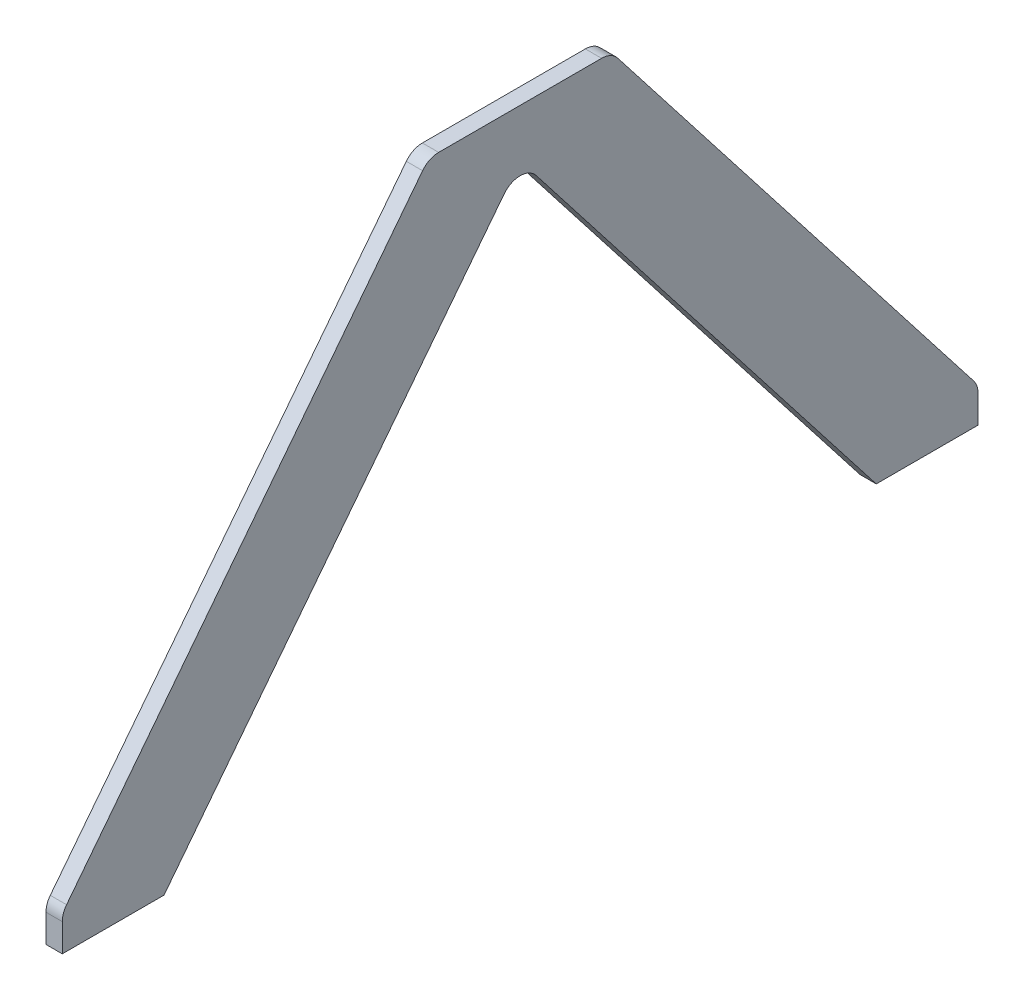
ISO-10303-21;
HEADER;
FILE_DESCRIPTION(('STEP AP214'),'2;1');
FILE_NAME('part.step','',(''),(''),'','','');
FILE_SCHEMA(('AUTOMOTIVE_DESIGN { 1 0 10303 214 1 1 1 1 }'));
ENDSEC;
DATA;
#1=APPLICATION_CONTEXT('core data for automotive mechanical design processes');
#2=APPLICATION_PROTOCOL_DEFINITION('international standard','automotive_design',2000,#1);
#3=PRODUCT_CONTEXT('',#1,'mechanical');
#4=PRODUCT('Part','Part','',(#3));
#5=PRODUCT_RELATED_PRODUCT_CATEGORY('part','',(#4));
#6=PRODUCT_DEFINITION_FORMATION('','',#4);
#7=PRODUCT_DEFINITION_CONTEXT('part definition',#1,'design');
#8=PRODUCT_DEFINITION('design','',#6,#7);
#9=PRODUCT_DEFINITION_SHAPE('','',#8);
#10=(LENGTH_UNIT() NAMED_UNIT(*) SI_UNIT(.MILLI.,.METRE.));
#11=(NAMED_UNIT(*) PLANE_ANGLE_UNIT() SI_UNIT($,.RADIAN.));
#12=(NAMED_UNIT(*) SI_UNIT($,.STERADIAN.) SOLID_ANGLE_UNIT());
#13=UNCERTAINTY_MEASURE_WITH_UNIT(LENGTH_MEASURE(1.E-05),#10,'distance_accuracy_value','');
#14=(GEOMETRIC_REPRESENTATION_CONTEXT(3) GLOBAL_UNCERTAINTY_ASSIGNED_CONTEXT((#13)) GLOBAL_UNIT_ASSIGNED_CONTEXT((#10,
#11,#12)) REPRESENTATION_CONTEXT('',''));
#15=CARTESIAN_POINT('',(0.,0.,0.));
#16=DIRECTION('',(0.,0.,1.));
#17=DIRECTION('',(1.,0.,0.));
#18=AXIS2_PLACEMENT_3D('',#15,#16,#17);
#19=CARTESIAN_POINT('',(1.11022302462516E-13,-25.,140.));
#20=DIRECTION('',(0.,0.,1.));
#21=DIRECTION('',(1.,0.,0.));
#22=AXIS2_PLACEMENT_3D('',#19,#20,#21);
#23=PLANE('',#22);
#24=DIRECTION('',(0.,1.,0.));
#25=VECTOR('',#24,1.);
#26=CARTESIAN_POINT('',(548.,0.,140.));
#27=LINE('',#26,#25);
#28=CARTESIAN_POINT('',(548.,0.,140.));
#29=VERTEX_POINT('',#28);
#30=CARTESIAN_POINT('',(548.,13.7269856950766,140.));
#31=VERTEX_POINT('',#30);
#32=EDGE_CURVE('E200',#29,#31,#27,.T.);
#33=ORIENTED_EDGE('',*,*,#32,.T.);
#34=DIRECTION('',(-1.,0.,0.));
#35=VECTOR('',#34,1.);
#36=CARTESIAN_POINT('',(540.,13.7269856950766,140.));
#37=LINE('',#36,#35);
#38=CARTESIAN_POINT('',(540.,13.7269856950766,140.));
#39=VERTEX_POINT('',#38);
#40=EDGE_CURVE('E204',#31,#39,#37,.T.);
#41=ORIENTED_EDGE('',*,*,#40,.T.);
#42=DIRECTION('',(0.,-1.,0.));
#43=VECTOR('',#42,1.);
#44=CARTESIAN_POINT('',(540.,0.,140.));
#45=LINE('',#44,#43);
#46=CARTESIAN_POINT('',(539.999999999998,0.,140.));
#47=VERTEX_POINT('',#46);
#48=EDGE_CURVE('E196',#39,#47,#45,.T.);
#49=ORIENTED_EDGE('',*,*,#48,.T.);
#50=DIRECTION('',(1.,0.,0.));
#51=VECTOR('',#50,1.);
#52=CARTESIAN_POINT('',(1.11022302462516E-13,0.,140.));
#53=LINE('',#52,#51);
#54=EDGE_CURVE('E197',#47,#29,#53,.T.);
#55=ORIENTED_EDGE('',*,*,#54,.T.);
#56=EDGE_LOOP('',(#33,#41,#49,#55));
#57=FACE_BOUND('',#56,.T.);
#58=ADVANCED_FACE('F34',(#57),#23,.T.);
#59=CARTESIAN_POINT('',(4.44089209850063E-13,0.,115.));
#60=DIRECTION('',(0.,1.,0.));
#61=DIRECTION('',(0.,0.,1.));
#62=AXIS2_PLACEMENT_3D('',#59,#60,#61);
#63=PLANE('',#62);
#64=ORIENTED_EDGE('',*,*,#54,.F.);
#65=DIRECTION('',(0.,0.,1.));
#66=VECTOR('',#65,1.);
#67=CARTESIAN_POINT('',(540.,0.,90.));
#68=LINE('',#67,#66);
#69=CARTESIAN_POINT('',(540.,0.,90.));
#70=VERTEX_POINT('',#69);
#71=EDGE_CURVE('E179',#70,#47,#68,.T.);
#72=ORIENTED_EDGE('',*,*,#71,.F.);
#73=DIRECTION('',(-1.,0.,0.));
#74=VECTOR('',#73,1.);
#75=CARTESIAN_POINT('',(548.,0.,89.9999999999999));
#76=LINE('',#75,#74);
#77=CARTESIAN_POINT('',(548.,0.,89.9999999999999));
#78=VERTEX_POINT('',#77);
#79=EDGE_CURVE('E176',#78,#70,#76,.T.);
#80=ORIENTED_EDGE('',*,*,#79,.F.);
#81=DIRECTION('',(0.,0.,-1.));
#82=VECTOR('',#81,1.);
#83=CARTESIAN_POINT('',(548.,0.,89.9999999999999));
#84=LINE('',#83,#82);
#85=EDGE_CURVE('E191',#29,#78,#84,.T.);
#86=ORIENTED_EDGE('',*,*,#85,.F.);
#87=EDGE_LOOP('',(#64,#72,#80,#86));
#88=FACE_BOUND('',#87,.T.);
#89=ADVANCED_FACE('F260',(#88),#63,.F.);
#90=CARTESIAN_POINT('',(548.,0.,89.9999999999999));
#91=DIRECTION('',(-1.,0.,0.));
#92=DIRECTION('',(0.,0.,1.));
#93=AXIS2_PLACEMENT_3D('',#90,#91,#92);
#94=PLANE('',#93);
#95=DIRECTION('',(0.,0.789278728365052,-0.614035087719298));
#96=VECTOR('',#95,1.);
#97=CARTESIAN_POINT('',(548.,30.701754385965,129.463936418253));
#98=LINE('',#97,#96);
#99=CARTESIAN_POINT('',(548.,19.8673365722696,137.89278728365));
#100=VERTEX_POINT('',#99);
#101=CARTESIAN_POINT('',(548.,244.763150312185,-37.0693848295465));
#102=VERTEX_POINT('',#101);
#103=EDGE_CURVE('E188',#100,#102,#98,.T.);
#104=ORIENTED_EDGE('',*,*,#103,.F.);
#105=CARTESIAN_POINT('',(548.,13.7269856950766,130.));
#106=DIRECTION('',(-1.,0.,0.));
#107=DIRECTION('',(0.,0.,1.));
#108=AXIS2_PLACEMENT_3D('',#105,#106,#107);
#109=CIRCLE('',#108,10.);
#110=EDGE_CURVE('E223',#100,#31,#109,.F.);
#111=ORIENTED_EDGE('',*,*,#110,.T.);
#112=ORIENTED_EDGE('',*,*,#32,.F.);
#113=ORIENTED_EDGE('',*,*,#85,.T.);
#114=DIRECTION('',(0.,0.789278728365052,-0.614035087719298));
#115=VECTOR('',#114,1.);
#116=CARTESIAN_POINT('',(548.,0.,89.9999999999999));
#117=LINE('',#116,#115);
#118=CARTESIAN_POINT('',(548.,214.799074175519,-77.1072127163495));
#119=VERTEX_POINT('',#118);
#120=EDGE_CURVE('E146',#78,#119,#117,.T.);
#121=ORIENTED_EDGE('',*,*,#120,.T.);
#122=CARTESIAN_POINT('',(548.,208.658723298326,-85.));
#123=DIRECTION('',(-1.,0.,0.));
#124=DIRECTION('',(0.,0.,1.));
#125=AXIS2_PLACEMENT_3D('',#122,#123,#124);
#126=CIRCLE('',#125,10.);
#127=CARTESIAN_POINT('',(548.,214.799074175519,-92.8927872836505));
#128=VERTEX_POINT('',#127);
#129=EDGE_CURVE('E42',#119,#128,#126,.T.);
#130=ORIENTED_EDGE('',*,*,#129,.T.);
#131=DIRECTION('',(0.,0.789278728365052,0.614035087719298));
#132=VECTOR('',#131,1.);
#133=CARTESIAN_POINT('',(548.,0.,-260.));
#134=LINE('',#133,#132);
#135=CARTESIAN_POINT('',(548.,0.,-260.));
#136=VERTEX_POINT('',#135);
#137=EDGE_CURVE('E154',#136,#128,#134,.T.);
#138=ORIENTED_EDGE('',*,*,#137,.F.);
#139=DIRECTION('',(0.,0.,-1.));
#140=VECTOR('',#139,1.);
#141=CARTESIAN_POINT('',(548.,0.,-299.463936418253));
#142=LINE('',#141,#140);
#143=CARTESIAN_POINT('',(548.000000000002,0.,-310.));
#144=VERTEX_POINT('',#143);
#145=EDGE_CURVE('E150',#136,#144,#142,.T.);
#146=ORIENTED_EDGE('',*,*,#145,.T.);
#147=DIRECTION('',(0.,-1.,0.));
#148=VECTOR('',#147,1.);
#149=CARTESIAN_POINT('',(548.,30.701754385965,-310.));
#150=LINE('',#149,#148);
#151=CARTESIAN_POINT('',(548.,13.7269856950767,-310.));
#152=VERTEX_POINT('',#151);
#153=EDGE_CURVE('E138',#152,#144,#150,.T.);
#154=ORIENTED_EDGE('',*,*,#153,.F.);
#155=CARTESIAN_POINT('',(548.000000000001,13.7269856950767,-300.));
#156=DIRECTION('',(-1.,0.,0.));
#157=DIRECTION('',(0.,0.,1.));
#158=AXIS2_PLACEMENT_3D('',#155,#156,#157);
#159=CIRCLE('',#158,10.);
#160=CARTESIAN_POINT('',(548.,19.8673365722697,-307.89278728365));
#161=VERTEX_POINT('',#160);
#162=EDGE_CURVE('E220',#152,#161,#159,.F.);
#163=ORIENTED_EDGE('',*,*,#162,.T.);
#164=DIRECTION('',(0.,0.789278728365052,0.614035087719298));
#165=VECTOR('',#164,1.);
#166=CARTESIAN_POINT('',(548.,30.701754385965,-299.463936418253));
#167=LINE('',#166,#165);
#168=CARTESIAN_POINT('',(548.,244.763150312184,-132.930615170453));
#169=VERTEX_POINT('',#168);
#170=EDGE_CURVE('E159',#161,#169,#167,.T.);
#171=ORIENTED_EDGE('',*,*,#170,.T.);
#172=CARTESIAN_POINT('',(548.,238.622799434992,-125.037827886803));
#173=DIRECTION('',(-1.,0.,0.));
#174=DIRECTION('',(0.,0.,1.));
#175=AXIS2_PLACEMENT_3D('',#172,#173,#174);
#176=CIRCLE('',#175,10.);
#177=CARTESIAN_POINT('',(548.,248.622799434992,-125.037827886803));
#178=VERTEX_POINT('',#177);
#179=EDGE_CURVE('E49',#169,#178,#176,.F.);
#180=ORIENTED_EDGE('',*,*,#179,.T.);
#181=DIRECTION('',(0.,0.,-1.));
#182=VECTOR('',#181,1.);
#183=CARTESIAN_POINT('',(547.999999999999,248.622799434992,89.9999999999999));
#184=LINE('',#183,#182);
#185=CARTESIAN_POINT('',(548.,248.622799434992,-44.962172113197));
#186=VERTEX_POINT('',#185);
#187=EDGE_CURVE('E177',#186,#178,#184,.T.);
#188=ORIENTED_EDGE('',*,*,#187,.F.);
#189=CARTESIAN_POINT('',(548.,238.622799434992,-44.962172113197));
#190=DIRECTION('',(-1.,0.,0.));
#191=DIRECTION('',(0.,0.,1.));
#192=AXIS2_PLACEMENT_3D('',#189,#190,#191);
#193=CIRCLE('',#192,10.);
#194=EDGE_CURVE('E57',#186,#102,#193,.F.);
#195=ORIENTED_EDGE('',*,*,#194,.T.);
#196=EDGE_LOOP('',(#104,#111,#112,#113,#121,#130,#138,#146,#154,#163,#171,#180,#188,#195));
#197=FACE_BOUND('',#196,.T.);
#198=ADVANCED_FACE('F152',(#197),#94,.F.);
#199=CARTESIAN_POINT('',(540.,30.701754385965,129.463936418253));
#200=DIRECTION('',(0.,-0.614035087719298,-0.789278728365052));
#201=DIRECTION('',(0.,0.789278728365052,-0.614035087719298));
#202=AXIS2_PLACEMENT_3D('',#199,#200,#201);
#203=PLANE('',#202);
#204=DIRECTION('',(0.,0.789278728365052,-0.614035087719298));
#205=VECTOR('',#204,1.);
#206=CARTESIAN_POINT('',(540.,30.701754385965,129.463936418253));
#207=LINE('',#206,#205);
#208=CARTESIAN_POINT('',(540.,19.8673365722696,137.892787283651));
#209=VERTEX_POINT('',#208);
#210=CARTESIAN_POINT('',(540.,244.763150312185,-37.0693848295466));
#211=VERTEX_POINT('',#210);
#212=EDGE_CURVE('E185',#209,#211,#207,.T.);
#213=ORIENTED_EDGE('',*,*,#212,.F.);
#214=DIRECTION('',(-1.,0.,0.));
#215=VECTOR('',#214,1.);
#216=CARTESIAN_POINT('',(548.,19.8673365722696,137.89278728365));
#217=LINE('',#216,#215);
#218=EDGE_CURVE('E217',#209,#100,#217,.F.);
#219=ORIENTED_EDGE('',*,*,#218,.T.);
#220=ORIENTED_EDGE('',*,*,#103,.T.);
#221=DIRECTION('',(1.,0.,0.));
#222=VECTOR('',#221,1.);
#223=CARTESIAN_POINT('',(540.,244.763150312184,-37.0693848295465));
#224=LINE('',#223,#222);
#225=EDGE_CURVE('E215',#102,#211,#224,.F.);
#226=ORIENTED_EDGE('',*,*,#225,.T.);
#227=EDGE_LOOP('',(#213,#219,#220,#226));
#228=FACE_BOUND('',#227,.T.);
#229=ADVANCED_FACE('F270',(#228),#203,.F.);
#230=CARTESIAN_POINT('',(540.,0.,90.));
#231=DIRECTION('',(1.,0.,0.));
#232=DIRECTION('',(0.,0.,-1.));
#233=AXIS2_PLACEMENT_3D('',#230,#231,#232);
#234=PLANE('',#233);
#235=ORIENTED_EDGE('',*,*,#48,.F.);
#236=CARTESIAN_POINT('',(540.,13.7269856950766,130.));
#237=DIRECTION('',(1.,0.,0.));
#238=DIRECTION('',(0.,0.,-1.));
#239=AXIS2_PLACEMENT_3D('',#236,#237,#238);
#240=CIRCLE('',#239,10.);
#241=EDGE_CURVE('E213',#39,#209,#240,.F.);
#242=ORIENTED_EDGE('',*,*,#241,.T.);
#243=ORIENTED_EDGE('',*,*,#212,.T.);
#244=CARTESIAN_POINT('',(540.,238.622799434992,-44.9621721131971));
#245=DIRECTION('',(1.,0.,0.));
#246=DIRECTION('',(0.,0.,-1.));
#247=AXIS2_PLACEMENT_3D('',#244,#245,#246);
#248=CIRCLE('',#247,10.);
#249=CARTESIAN_POINT('',(540.,248.622799434992,-44.9621721131971));
#250=VERTEX_POINT('',#249);
#251=EDGE_CURVE('E211',#211,#250,#248,.F.);
#252=ORIENTED_EDGE('',*,*,#251,.T.);
#253=DIRECTION('',(0.,0.,1.));
#254=VECTOR('',#253,1.);
#255=CARTESIAN_POINT('',(539.999999999999,248.622799434992,90.));
#256=LINE('',#255,#254);
#257=CARTESIAN_POINT('',(540.,248.622799434992,-125.037827886803));
#258=VERTEX_POINT('',#257);
#259=EDGE_CURVE('E180',#258,#250,#256,.T.);
#260=ORIENTED_EDGE('',*,*,#259,.F.);
#261=CARTESIAN_POINT('',(540.,238.622799434992,-125.037827886803));
#262=DIRECTION('',(1.,0.,0.));
#263=DIRECTION('',(0.,0.,-1.));
#264=AXIS2_PLACEMENT_3D('',#261,#262,#263);
#265=CIRCLE('',#264,10.);
#266=CARTESIAN_POINT('',(540.,244.763150312184,-132.930615170454));
#267=VERTEX_POINT('',#266);
#268=EDGE_CURVE('E207',#258,#267,#265,.F.);
#269=ORIENTED_EDGE('',*,*,#268,.T.);
#270=DIRECTION('',(0.,0.789278728365052,0.614035087719298));
#271=VECTOR('',#270,1.);
#272=CARTESIAN_POINT('',(540.,30.701754385965,-299.463936418252));
#273=LINE('',#272,#271);
#274=CARTESIAN_POINT('',(540.,19.8673365722697,-307.89278728365));
#275=VERTEX_POINT('',#274);
#276=EDGE_CURVE('E158',#275,#267,#273,.T.);
#277=ORIENTED_EDGE('',*,*,#276,.F.);
#278=CARTESIAN_POINT('',(540.000000000001,13.7269856950767,-300.));
#279=DIRECTION('',(1.,0.,0.));
#280=DIRECTION('',(0.,0.,-1.));
#281=AXIS2_PLACEMENT_3D('',#278,#279,#280);
#282=CIRCLE('',#281,10.);
#283=CARTESIAN_POINT('',(540.,13.7269856950767,-310.));
#284=VERTEX_POINT('',#283);
#285=EDGE_CURVE('E209',#275,#284,#282,.F.);
#286=ORIENTED_EDGE('',*,*,#285,.T.);
#287=DIRECTION('',(0.,1.,0.));
#288=VECTOR('',#287,1.);
#289=CARTESIAN_POINT('',(540.,30.701754385965,-310.));
#290=LINE('',#289,#288);
#291=CARTESIAN_POINT('',(540.,0.,-310.));
#292=VERTEX_POINT('',#291);
#293=EDGE_CURVE('E147',#292,#284,#290,.T.);
#294=ORIENTED_EDGE('',*,*,#293,.F.);
#295=DIRECTION('',(0.,0.,1.));
#296=VECTOR('',#295,1.);
#297=CARTESIAN_POINT('',(540.,0.,-299.463936418253));
#298=LINE('',#297,#296);
#299=CARTESIAN_POINT('',(540.,0.,-260.));
#300=VERTEX_POINT('',#299);
#301=EDGE_CURVE('E162',#292,#300,#298,.T.);
#302=ORIENTED_EDGE('',*,*,#301,.T.);
#303=DIRECTION('',(0.,0.789278728365052,0.614035087719298));
#304=VECTOR('',#303,1.);
#305=CARTESIAN_POINT('',(540.,0.,-260.));
#306=LINE('',#305,#304);
#307=CARTESIAN_POINT('',(540.,214.799074175519,-92.8927872836505));
#308=VERTEX_POINT('',#307);
#309=EDGE_CURVE('E248',#300,#308,#306,.T.);
#310=ORIENTED_EDGE('',*,*,#309,.T.);
#311=CARTESIAN_POINT('',(540.,208.658723298326,-85.));
#312=DIRECTION('',(1.,0.,0.));
#313=DIRECTION('',(0.,0.,-1.));
#314=AXIS2_PLACEMENT_3D('',#311,#312,#313);
#315=CIRCLE('',#314,10.);
#316=CARTESIAN_POINT('',(540.,214.799074175519,-77.1072127163495));
#317=VERTEX_POINT('',#316);
#318=EDGE_CURVE('E11',#308,#317,#315,.T.);
#319=ORIENTED_EDGE('',*,*,#318,.T.);
#320=DIRECTION('',(0.,0.789278728365052,-0.614035087719298));
#321=VECTOR('',#320,1.);
#322=CARTESIAN_POINT('',(540.,0.,90.));
#323=LINE('',#322,#321);
#324=EDGE_CURVE('E173',#70,#317,#323,.T.);
#325=ORIENTED_EDGE('',*,*,#324,.F.);
#326=ORIENTED_EDGE('',*,*,#71,.T.);
#327=EDGE_LOOP('',(#235,#242,#243,#252,#260,#269,#277,#286,#294,#302,#310,#319,#325,#326));
#328=FACE_BOUND('',#327,.T.);
#329=ADVANCED_FACE('F255',(#328),#234,.F.);
#330=CARTESIAN_POINT('',(548.,0.,89.9999999999999));
#331=DIRECTION('',(0.,0.614035087719298,0.789278728365052));
#332=DIRECTION('',(0.,-0.789278728365052,0.614035087719298));
#333=AXIS2_PLACEMENT_3D('',#330,#331,#332);
#334=PLANE('',#333);
#335=ORIENTED_EDGE('',*,*,#324,.T.);
#336=DIRECTION('',(1.,0.,0.));
#337=VECTOR('',#336,1.);
#338=CARTESIAN_POINT('',(548.,214.799074175519,-77.1072127163495));
#339=LINE('',#338,#337);
#340=EDGE_CURVE('E235',#317,#119,#339,.T.);
#341=ORIENTED_EDGE('',*,*,#340,.T.);
#342=ORIENTED_EDGE('',*,*,#120,.F.);
#343=ORIENTED_EDGE('',*,*,#79,.T.);
#344=EDGE_LOOP('',(#335,#341,#342,#343));
#345=FACE_BOUND('',#344,.T.);
#346=ADVANCED_FACE('F257',(#345),#334,.F.);
#347=CARTESIAN_POINT('',(-2.22044604925031E-13,248.622799434992,0.));
#348=DIRECTION('',(0.,1.,0.));
#349=DIRECTION('',(0.,0.,1.));
#350=AXIS2_PLACEMENT_3D('',#347,#348,#349);
#351=PLANE('',#350);
#352=ORIENTED_EDGE('',*,*,#259,.T.);
#353=DIRECTION('',(1.,0.,0.));
#354=VECTOR('',#353,1.);
#355=CARTESIAN_POINT('',(548.,248.622799434992,-44.962172113197));
#356=LINE('',#355,#354);
#357=EDGE_CURVE('E228',#250,#186,#356,.T.);
#358=ORIENTED_EDGE('',*,*,#357,.T.);
#359=ORIENTED_EDGE('',*,*,#187,.T.);
#360=DIRECTION('',(-1.,0.,0.));
#361=VECTOR('',#360,1.);
#362=CARTESIAN_POINT('',(540.,248.622799434992,-125.037827886803));
#363=LINE('',#362,#361);
#364=EDGE_CURVE('E225',#178,#258,#363,.T.);
#365=ORIENTED_EDGE('',*,*,#364,.T.);
#366=EDGE_LOOP('',(#352,#358,#359,#365));
#367=FACE_BOUND('',#366,.T.);
#368=ADVANCED_FACE('F297',(#367),#351,.T.);
#369=CARTESIAN_POINT('',(548.,30.701754385965,-299.463936418253));
#370=DIRECTION('',(0.,-0.614035087719298,0.789278728365052));
#371=DIRECTION('',(0.,-0.789278728365052,-0.614035087719298));
#372=AXIS2_PLACEMENT_3D('',#369,#370,#371);
#373=PLANE('',#372);
#374=ORIENTED_EDGE('',*,*,#170,.F.);
#375=DIRECTION('',(1.,0.,0.));
#376=VECTOR('',#375,1.);
#377=CARTESIAN_POINT('',(540.,19.8673365722697,-307.89278728365));
#378=LINE('',#377,#376);
#379=EDGE_CURVE('E233',#161,#275,#378,.F.);
#380=ORIENTED_EDGE('',*,*,#379,.T.);
#381=ORIENTED_EDGE('',*,*,#276,.T.);
#382=DIRECTION('',(-1.,0.,0.));
#383=VECTOR('',#382,1.);
#384=CARTESIAN_POINT('',(548.,244.763150312184,-132.930615170453));
#385=LINE('',#384,#383);
#386=EDGE_CURVE('E231',#267,#169,#385,.F.);
#387=ORIENTED_EDGE('',*,*,#386,.T.);
#388=EDGE_LOOP('',(#374,#380,#381,#387));
#389=FACE_BOUND('',#388,.T.);
#390=ADVANCED_FACE('F303',(#389),#373,.F.);
#391=CARTESIAN_POINT('',(1.11022302462516E-13,0.,-285.));
#392=DIRECTION('',(0.,1.,0.));
#393=DIRECTION('',(0.,0.,1.));
#394=AXIS2_PLACEMENT_3D('',#391,#392,#393);
#395=PLANE('',#394);
#396=DIRECTION('',(1.,0.,0.));
#397=VECTOR('',#396,1.);
#398=CARTESIAN_POINT('',(540.,0.,-260.));
#399=LINE('',#398,#397);
#400=EDGE_CURVE('E247',#300,#136,#399,.T.);
#401=ORIENTED_EDGE('',*,*,#400,.F.);
#402=ORIENTED_EDGE('',*,*,#301,.F.);
#403=DIRECTION('',(-1.,0.,0.));
#404=VECTOR('',#403,1.);
#405=CARTESIAN_POINT('',(4.44089209850063E-13,0.,-310.));
#406=LINE('',#405,#404);
#407=EDGE_CURVE('E143',#144,#292,#406,.T.);
#408=ORIENTED_EDGE('',*,*,#407,.F.);
#409=ORIENTED_EDGE('',*,*,#145,.F.);
#410=EDGE_LOOP('',(#401,#402,#408,#409));
#411=FACE_BOUND('',#410,.T.);
#412=ADVANCED_FACE('F161',(#411),#395,.F.);
#413=CARTESIAN_POINT('',(3.33066907387547E-13,-25.,-310.));
#414=DIRECTION('',(0.,0.,-1.));
#415=DIRECTION('',(-1.,0.,0.));
#416=AXIS2_PLACEMENT_3D('',#413,#414,#415);
#417=PLANE('',#416);
#418=ORIENTED_EDGE('',*,*,#293,.T.);
#419=DIRECTION('',(1.,0.,0.));
#420=VECTOR('',#419,1.);
#421=CARTESIAN_POINT('',(548.,13.7269856950767,-310.));
#422=LINE('',#421,#420);
#423=EDGE_CURVE('E145',#284,#152,#422,.T.);
#424=ORIENTED_EDGE('',*,*,#423,.T.);
#425=ORIENTED_EDGE('',*,*,#153,.T.);
#426=ORIENTED_EDGE('',*,*,#407,.T.);
#427=EDGE_LOOP('',(#418,#424,#425,#426));
#428=FACE_BOUND('',#427,.T.);
#429=ADVANCED_FACE('F141',(#428),#417,.T.);
#430=CARTESIAN_POINT('',(540.,0.,-260.));
#431=DIRECTION('',(0.,0.614035087719298,-0.789278728365052));
#432=DIRECTION('',(0.,0.789278728365052,0.614035087719298));
#433=AXIS2_PLACEMENT_3D('',#430,#431,#432);
#434=PLANE('',#433);
#435=ORIENTED_EDGE('',*,*,#137,.T.);
#436=DIRECTION('',(1.,0.,0.));
#437=VECTOR('',#436,1.);
#438=CARTESIAN_POINT('',(540.,214.799074175519,-92.8927872836505));
#439=LINE('',#438,#437);
#440=EDGE_CURVE('E238',#128,#308,#439,.F.);
#441=ORIENTED_EDGE('',*,*,#440,.T.);
#442=ORIENTED_EDGE('',*,*,#309,.F.);
#443=ORIENTED_EDGE('',*,*,#400,.T.);
#444=EDGE_LOOP('',(#435,#441,#442,#443));
#445=FACE_BOUND('',#444,.T.);
#446=ADVANCED_FACE('F244',(#445),#434,.F.);
#447=CARTESIAN_POINT('',(0.,13.7269856950753,130.));
#448=DIRECTION('',(1.,0.,0.));
#449=DIRECTION('',(0.,1.,0.));
#450=AXIS2_PLACEMENT_3D('',#447,#448,#449);
#451=CYLINDRICAL_SURFACE('',#450,10.);
#452=ORIENTED_EDGE('',*,*,#110,.F.);
#453=ORIENTED_EDGE('',*,*,#218,.F.);
#454=ORIENTED_EDGE('',*,*,#241,.F.);
#455=ORIENTED_EDGE('',*,*,#40,.F.);
#456=EDGE_LOOP('',(#452,#453,#454,#455));
#457=FACE_BOUND('',#456,.T.);
#458=ADVANCED_FACE('F271',(#457),#451,.T.);
#459=CARTESIAN_POINT('',(1.11022302462516E-13,238.622799434992,-44.962172113198));
#460=DIRECTION('',(-1.,0.,0.));
#461=DIRECTION('',(0.,0.,1.));
#462=AXIS2_PLACEMENT_3D('',#459,#460,#461);
#463=CYLINDRICAL_SURFACE('',#462,10.);
#464=ORIENTED_EDGE('',*,*,#251,.F.);
#465=ORIENTED_EDGE('',*,*,#225,.F.);
#466=ORIENTED_EDGE('',*,*,#194,.F.);
#467=ORIENTED_EDGE('',*,*,#357,.F.);
#468=EDGE_LOOP('',(#464,#465,#466,#467));
#469=FACE_BOUND('',#468,.T.);
#470=ADVANCED_FACE('F273',(#469),#463,.T.);
#471=CARTESIAN_POINT('',(3.33066907387547E-13,13.7269856950779,-300.));
#472=DIRECTION('',(-1.,0.,0.));
#473=DIRECTION('',(0.,-1.,0.));
#474=AXIS2_PLACEMENT_3D('',#471,#472,#473);
#475=CYLINDRICAL_SURFACE('',#474,10.);
#476=ORIENTED_EDGE('',*,*,#285,.F.);
#477=ORIENTED_EDGE('',*,*,#379,.F.);
#478=ORIENTED_EDGE('',*,*,#162,.F.);
#479=ORIENTED_EDGE('',*,*,#423,.F.);
#480=EDGE_LOOP('',(#476,#477,#478,#479));
#481=FACE_BOUND('',#480,.T.);
#482=ADVANCED_FACE('F279',(#481),#475,.T.);
#483=CARTESIAN_POINT('',(548.000000000001,208.658723298326,-85.));
#484=DIRECTION('',(-1.,0.,0.));
#485=DIRECTION('',(0.,0.,1.));
#486=AXIS2_PLACEMENT_3D('',#483,#484,#485);
#487=CYLINDRICAL_SURFACE('',#486,10.);
#488=ORIENTED_EDGE('',*,*,#318,.F.);
#489=ORIENTED_EDGE('',*,*,#440,.F.);
#490=ORIENTED_EDGE('',*,*,#129,.F.);
#491=ORIENTED_EDGE('',*,*,#340,.F.);
#492=EDGE_LOOP('',(#488,#489,#490,#491));
#493=FACE_BOUND('',#492,.T.);
#494=ADVANCED_FACE('F251',(#493),#487,.F.);
#495=CARTESIAN_POINT('',(1.11022302462516E-13,238.622799434992,-125.037827886804));
#496=DIRECTION('',(1.,0.,0.));
#497=DIRECTION('',(0.,0.,-1.));
#498=AXIS2_PLACEMENT_3D('',#495,#496,#497);
#499=CYLINDRICAL_SURFACE('',#498,10.);
#500=ORIENTED_EDGE('',*,*,#179,.F.);
#501=ORIENTED_EDGE('',*,*,#386,.F.);
#502=ORIENTED_EDGE('',*,*,#268,.F.);
#503=ORIENTED_EDGE('',*,*,#364,.F.);
#504=EDGE_LOOP('',(#500,#501,#502,#503));
#505=FACE_BOUND('',#504,.T.);
#506=ADVANCED_FACE('F36',(#505),#499,.T.);
#507=CLOSED_SHELL('',(#58,#89,#198,#229,#329,#346,#368,#390,#412,#429,#446,#458,#470,#482,#494,#506));
#508=MANIFOLD_SOLID_BREP('B2',#507);
#509=ADVANCED_BREP_SHAPE_REPRESENTATION('',(#18,#508),#14);
#510=SHAPE_DEFINITION_REPRESENTATION(#9,#509);
ENDSEC;
END-ISO-10303-21;
